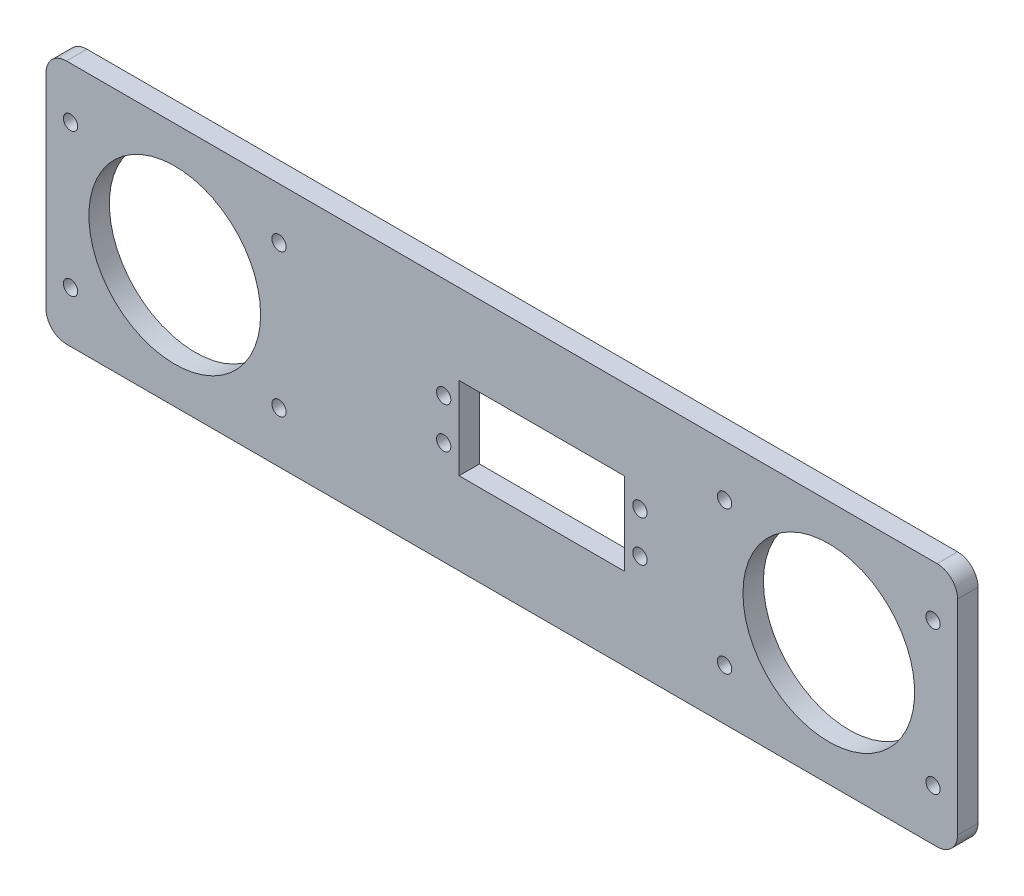
ISO-10303-21;
HEADER;
FILE_DESCRIPTION(('STEP AP214'),'2;1');
FILE_NAME('part.step','',(''),(''),'','','');
FILE_SCHEMA(('AUTOMOTIVE_DESIGN { 1 0 10303 214 1 1 1 1 }'));
ENDSEC;
DATA;
#1=APPLICATION_CONTEXT('core data for automotive mechanical design processes');
#2=APPLICATION_PROTOCOL_DEFINITION('international standard','automotive_design',2000,#1);
#3=PRODUCT_CONTEXT('',#1,'mechanical');
#4=PRODUCT('Part','Part','',(#3));
#5=PRODUCT_RELATED_PRODUCT_CATEGORY('part','',(#4));
#6=PRODUCT_DEFINITION_FORMATION('','',#4);
#7=PRODUCT_DEFINITION_CONTEXT('part definition',#1,'design');
#8=PRODUCT_DEFINITION('design','',#6,#7);
#9=PRODUCT_DEFINITION_SHAPE('','',#8);
#10=(LENGTH_UNIT() NAMED_UNIT(*) SI_UNIT(.MILLI.,.METRE.));
#11=(NAMED_UNIT(*) PLANE_ANGLE_UNIT() SI_UNIT($,.RADIAN.));
#12=(NAMED_UNIT(*) SI_UNIT($,.STERADIAN.) SOLID_ANGLE_UNIT());
#13=UNCERTAINTY_MEASURE_WITH_UNIT(LENGTH_MEASURE(1.E-05),#10,'distance_accuracy_value','');
#14=(GEOMETRIC_REPRESENTATION_CONTEXT(3) GLOBAL_UNCERTAINTY_ASSIGNED_CONTEXT((#13)) GLOBAL_UNIT_ASSIGNED_CONTEXT((#10,
#11,#12)) REPRESENTATION_CONTEXT('',''));
#15=CARTESIAN_POINT('',(0.,0.,0.));
#16=DIRECTION('',(0.,0.,1.));
#17=DIRECTION('',(1.,0.,0.));
#18=AXIS2_PLACEMENT_3D('',#15,#16,#17);
#19=CARTESIAN_POINT('',(106.5,25.,5.));
#20=DIRECTION('',(0.,0.,1.));
#21=DIRECTION('',(1.,0.,0.));
#22=AXIS2_PLACEMENT_3D('',#19,#20,#21);
#23=PLANE('',#22);
#24=CARTESIAN_POINT('',(105.500000000004,-17.5000000000001,5.));
#25=DIRECTION('',(0.,0.,1.));
#26=DIRECTION('',(-1.,0.,0.));
#27=AXIS2_PLACEMENT_3D('',#24,#25,#26);
#28=CIRCLE('',#27,1.75);
#29=CARTESIAN_POINT('',(103.750000000004,-17.5000000000001,5.));
#30=VERTEX_POINT('',#29);
#31=EDGE_CURVE('E405',#30,#30,#28,.T.);
#32=ORIENTED_EDGE('',*,*,#31,.F.);
#33=EDGE_LOOP('',(#32));
#34=FACE_BOUND('',#33,.T.);
#35=CARTESIAN_POINT('',(54.5000000000038,-17.5000000000001,5.));
#36=DIRECTION('',(0.,0.,1.));
#37=DIRECTION('',(-1.,0.,0.));
#38=AXIS2_PLACEMENT_3D('',#35,#36,#37);
#39=CIRCLE('',#38,1.75);
#40=CARTESIAN_POINT('',(52.7500000000038,-17.5000000000001,5.));
#41=VERTEX_POINT('',#40);
#42=EDGE_CURVE('E417',#41,#41,#39,.T.);
#43=ORIENTED_EDGE('',*,*,#42,.F.);
#44=EDGE_LOOP('',(#43));
#45=FACE_BOUND('',#44,.T.);
#46=CARTESIAN_POINT('',(-105.500000000004,17.4999999999999,5.));
#47=DIRECTION('',(0.,0.,1.));
#48=DIRECTION('',(1.,0.,0.));
#49=AXIS2_PLACEMENT_3D('',#46,#47,#48);
#50=CIRCLE('',#49,1.75);
#51=CARTESIAN_POINT('',(-103.750000000004,17.4999999999999,5.));
#52=VERTEX_POINT('',#51);
#53=EDGE_CURVE('E429',#52,#52,#50,.T.);
#54=ORIENTED_EDGE('',*,*,#53,.F.);
#55=EDGE_LOOP('',(#54));
#56=FACE_BOUND('',#55,.T.);
#57=CARTESIAN_POINT('',(-54.5000000000038,-17.5000000000001,5.));
#58=DIRECTION('',(0.,0.,1.));
#59=DIRECTION('',(1.,0.,0.));
#60=AXIS2_PLACEMENT_3D('',#57,#58,#59);
#61=CIRCLE('',#60,1.75);
#62=CARTESIAN_POINT('',(-52.7500000000038,-17.5000000000001,5.));
#63=VERTEX_POINT('',#62);
#64=EDGE_CURVE('E153',#63,#63,#61,.T.);
#65=ORIENTED_EDGE('',*,*,#64,.F.);
#66=EDGE_LOOP('',(#65));
#67=FACE_BOUND('',#66,.T.);
#68=CARTESIAN_POINT('',(-14.2111390943348,-4.76231465688467,5.));
#69=DIRECTION('',(0.,0.,1.));
#70=DIRECTION('',(1.,0.,0.));
#71=AXIS2_PLACEMENT_3D('',#68,#69,#70);
#72=CIRCLE('',#71,1.75);
#73=CARTESIAN_POINT('',(-12.4611390943348,-4.76231465688467,5.));
#74=VERTEX_POINT('',#73);
#75=EDGE_CURVE('E169',#74,#74,#72,.T.);
#76=ORIENTED_EDGE('',*,*,#75,.F.);
#77=EDGE_LOOP('',(#76));
#78=FACE_BOUND('',#77,.T.);
#79=CARTESIAN_POINT('',(33.7888609056652,-4.76231465688467,5.));
#80=DIRECTION('',(0.,0.,1.));
#81=DIRECTION('',(1.,0.,0.));
#82=AXIS2_PLACEMENT_3D('',#79,#80,#81);
#83=CIRCLE('',#82,1.75);
#84=CARTESIAN_POINT('',(35.5388609056652,-4.76231465688467,5.));
#85=VERTEX_POINT('',#84);
#86=EDGE_CURVE('E181',#85,#85,#83,.T.);
#87=ORIENTED_EDGE('',*,*,#86,.F.);
#88=EDGE_LOOP('',(#87));
#89=FACE_BOUND('',#88,.T.);
#90=CARTESIAN_POINT('',(-80.,0.,5.));
#91=DIRECTION('',(0.,0.,1.));
#92=DIRECTION('',(1.,0.,0.));
#93=AXIS2_PLACEMENT_3D('',#90,#91,#92);
#94=CIRCLE('',#93,21.);
#95=CARTESIAN_POINT('',(-59.,0.,5.));
#96=VERTEX_POINT('',#95);
#97=EDGE_CURVE('E193',#96,#96,#94,.T.);
#98=ORIENTED_EDGE('',*,*,#97,.F.);
#99=EDGE_LOOP('',(#98));
#100=FACE_BOUND('',#99,.T.);
#101=CARTESIAN_POINT('',(106.5,25.,5.));
#102=DIRECTION('',(0.,0.,1.));
#103=DIRECTION('',(1.,0.,0.));
#104=AXIS2_PLACEMENT_3D('',#101,#102,#103);
#105=CIRCLE('',#104,5.);
#106=CARTESIAN_POINT('',(111.5,25.,5.));
#107=VERTEX_POINT('',#106);
#108=CARTESIAN_POINT('',(106.5,30.,5.));
#109=VERTEX_POINT('',#108);
#110=EDGE_CURVE('E199',#107,#109,#105,.T.);
#111=ORIENTED_EDGE('',*,*,#110,.T.);
#112=DIRECTION('',(-1.,0.,0.));
#113=VECTOR('',#112,1.);
#114=CARTESIAN_POINT('',(106.5,30.,5.));
#115=LINE('',#114,#113);
#116=CARTESIAN_POINT('',(-106.5,30.,5.));
#117=VERTEX_POINT('',#116);
#118=EDGE_CURVE('E202',#109,#117,#115,.T.);
#119=ORIENTED_EDGE('',*,*,#118,.T.);
#120=CARTESIAN_POINT('',(-106.5,25.,5.));
#121=DIRECTION('',(0.,0.,1.));
#122=DIRECTION('',(1.,0.,0.));
#123=AXIS2_PLACEMENT_3D('',#120,#121,#122);
#124=CIRCLE('',#123,5.);
#125=CARTESIAN_POINT('',(-111.5,25.,5.));
#126=VERTEX_POINT('',#125);
#127=EDGE_CURVE('E205',#117,#126,#124,.T.);
#128=ORIENTED_EDGE('',*,*,#127,.T.);
#129=DIRECTION('',(0.,-1.,0.));
#130=VECTOR('',#129,1.);
#131=CARTESIAN_POINT('',(-111.5,-25.,5.));
#132=LINE('',#131,#130);
#133=CARTESIAN_POINT('',(-111.5,-25.,5.));
#134=VERTEX_POINT('',#133);
#135=EDGE_CURVE('E207',#126,#134,#132,.T.);
#136=ORIENTED_EDGE('',*,*,#135,.T.);
#137=CARTESIAN_POINT('',(-106.5,-25.,5.));
#138=DIRECTION('',(0.,0.,1.));
#139=DIRECTION('',(-1.,0.,0.));
#140=AXIS2_PLACEMENT_3D('',#137,#138,#139);
#141=CIRCLE('',#140,5.);
#142=CARTESIAN_POINT('',(-106.5,-30.,5.));
#143=VERTEX_POINT('',#142);
#144=EDGE_CURVE('E209',#134,#143,#141,.T.);
#145=ORIENTED_EDGE('',*,*,#144,.T.);
#146=DIRECTION('',(1.,0.,0.));
#147=VECTOR('',#146,1.);
#148=CARTESIAN_POINT('',(106.5,-30.,5.));
#149=LINE('',#148,#147);
#150=CARTESIAN_POINT('',(106.5,-30.,5.));
#151=VERTEX_POINT('',#150);
#152=EDGE_CURVE('E211',#143,#151,#149,.T.);
#153=ORIENTED_EDGE('',*,*,#152,.T.);
#154=CARTESIAN_POINT('',(106.5,-25.,5.));
#155=DIRECTION('',(0.,0.,1.));
#156=DIRECTION('',(1.,0.,0.));
#157=AXIS2_PLACEMENT_3D('',#154,#155,#156);
#158=CIRCLE('',#157,5.);
#159=CARTESIAN_POINT('',(111.5,-25.,5.));
#160=VERTEX_POINT('',#159);
#161=EDGE_CURVE('E213',#151,#160,#158,.T.);
#162=ORIENTED_EDGE('',*,*,#161,.T.);
#163=DIRECTION('',(0.,1.,0.));
#164=VECTOR('',#163,1.);
#165=CARTESIAN_POINT('',(111.5,-25.,5.));
#166=LINE('',#165,#164);
#167=EDGE_CURVE('E215',#160,#107,#166,.T.);
#168=ORIENTED_EDGE('',*,*,#167,.T.);
#169=EDGE_LOOP('',(#111,#119,#128,#136,#145,#153,#162,#168));
#170=FACE_BOUND('',#169,.T.);
#171=CARTESIAN_POINT('',(80.,0.,5.));
#172=DIRECTION('',(0.,0.,1.));
#173=DIRECTION('',(-1.,0.,0.));
#174=AXIS2_PLACEMENT_3D('',#171,#172,#173);
#175=CIRCLE('',#174,21.);
#176=CARTESIAN_POINT('',(59.,0.,5.));
#177=VERTEX_POINT('',#176);
#178=EDGE_CURVE('E187',#177,#177,#175,.T.);
#179=ORIENTED_EDGE('',*,*,#178,.F.);
#180=EDGE_LOOP('',(#179));
#181=FACE_BOUND('',#180,.T.);
#182=CARTESIAN_POINT('',(33.7888609056652,5.23768534311533,5.));
#183=DIRECTION('',(0.,0.,1.));
#184=DIRECTION('',(1.,0.,0.));
#185=AXIS2_PLACEMENT_3D('',#182,#183,#184);
#186=CIRCLE('',#185,1.75);
#187=CARTESIAN_POINT('',(35.5388609056652,5.23768534311533,5.));
#188=VERTEX_POINT('',#187);
#189=EDGE_CURVE('E175',#188,#188,#186,.T.);
#190=ORIENTED_EDGE('',*,*,#189,.F.);
#191=EDGE_LOOP('',(#190));
#192=FACE_BOUND('',#191,.T.);
#193=CARTESIAN_POINT('',(-14.2111390943348,5.23768534311533,5.));
#194=DIRECTION('',(0.,0.,1.));
#195=DIRECTION('',(1.,0.,0.));
#196=AXIS2_PLACEMENT_3D('',#193,#194,#195);
#197=CIRCLE('',#196,1.75);
#198=CARTESIAN_POINT('',(-12.4611390943348,5.23768534311533,5.));
#199=VERTEX_POINT('',#198);
#200=EDGE_CURVE('E163',#199,#199,#197,.T.);
#201=ORIENTED_EDGE('',*,*,#200,.F.);
#202=EDGE_LOOP('',(#201));
#203=FACE_BOUND('',#202,.T.);
#204=DIRECTION('',(0.,1.,0.));
#205=VECTOR('',#204,1.);
#206=CARTESIAN_POINT('',(30.0388609056652,-9.86231465688467,5.));
#207=LINE('',#206,#205);
#208=CARTESIAN_POINT('',(30.0388609056652,-9.86231465688467,5.));
#209=VERTEX_POINT('',#208);
#210=CARTESIAN_POINT('',(30.0388609056652,10.3376853431153,5.));
#211=VERTEX_POINT('',#210);
#212=EDGE_CURVE('E132',#209,#211,#207,.T.);
#213=ORIENTED_EDGE('',*,*,#212,.F.);
#214=DIRECTION('',(1.,0.,0.));
#215=VECTOR('',#214,1.);
#216=CARTESIAN_POINT('',(-10.4611390943348,-9.86231465688467,5.));
#217=LINE('',#216,#215);
#218=CARTESIAN_POINT('',(-10.4611390943348,-9.86231465688467,5.));
#219=VERTEX_POINT('',#218);
#220=EDGE_CURVE('E124',#219,#209,#217,.T.);
#221=ORIENTED_EDGE('',*,*,#220,.F.);
#222=DIRECTION('',(0.,-1.,0.));
#223=VECTOR('',#222,1.);
#224=CARTESIAN_POINT('',(-10.4611390943348,10.3376853431153,5.));
#225=LINE('',#224,#223);
#226=CARTESIAN_POINT('',(-10.4611390943348,10.3376853431153,5.));
#227=VERTEX_POINT('',#226);
#228=EDGE_CURVE('E147',#227,#219,#225,.T.);
#229=ORIENTED_EDGE('',*,*,#228,.F.);
#230=DIRECTION('',(-1.,0.,0.));
#231=VECTOR('',#230,1.);
#232=CARTESIAN_POINT('',(30.0388609056652,10.3376853431153,5.));
#233=LINE('',#232,#231);
#234=EDGE_CURVE('E145',#211,#227,#233,.T.);
#235=ORIENTED_EDGE('',*,*,#234,.F.);
#236=EDGE_LOOP('',(#213,#221,#229,#235));
#237=FACE_BOUND('',#236,.T.);
#238=CARTESIAN_POINT('',(-105.500000000004,-17.5000000000001,5.));
#239=DIRECTION('',(0.,0.,1.));
#240=DIRECTION('',(1.,0.,0.));
#241=AXIS2_PLACEMENT_3D('',#238,#239,#240);
#242=CIRCLE('',#241,1.75);
#243=CARTESIAN_POINT('',(-103.750000000004,-17.5000000000001,5.));
#244=VERTEX_POINT('',#243);
#245=EDGE_CURVE('E435',#244,#244,#242,.T.);
#246=ORIENTED_EDGE('',*,*,#245,.F.);
#247=EDGE_LOOP('',(#246));
#248=FACE_BOUND('',#247,.T.);
#249=CARTESIAN_POINT('',(-54.5000000000045,17.5000000000001,5.));
#250=DIRECTION('',(0.,0.,1.));
#251=DIRECTION('',(1.,0.,0.));
#252=AXIS2_PLACEMENT_3D('',#249,#250,#251);
#253=CIRCLE('',#252,1.75);
#254=CARTESIAN_POINT('',(-52.7500000000045,17.5000000000001,5.));
#255=VERTEX_POINT('',#254);
#256=EDGE_CURVE('E423',#255,#255,#253,.T.);
#257=ORIENTED_EDGE('',*,*,#256,.F.);
#258=EDGE_LOOP('',(#257));
#259=FACE_BOUND('',#258,.T.);
#260=CARTESIAN_POINT('',(54.5000000000045,17.5000000000001,5.));
#261=DIRECTION('',(0.,0.,1.));
#262=DIRECTION('',(-1.,0.,0.));
#263=AXIS2_PLACEMENT_3D('',#260,#261,#262);
#264=CIRCLE('',#263,1.75);
#265=CARTESIAN_POINT('',(52.7500000000045,17.5000000000001,5.));
#266=VERTEX_POINT('',#265);
#267=EDGE_CURVE('E411',#266,#266,#264,.T.);
#268=ORIENTED_EDGE('',*,*,#267,.F.);
#269=EDGE_LOOP('',(#268));
#270=FACE_BOUND('',#269,.T.);
#271=CARTESIAN_POINT('',(105.500000000004,17.4999999999999,5.));
#272=DIRECTION('',(0.,0.,1.));
#273=DIRECTION('',(-1.,0.,0.));
#274=AXIS2_PLACEMENT_3D('',#271,#272,#273);
#275=CIRCLE('',#274,1.75);
#276=CARTESIAN_POINT('',(103.750000000004,17.4999999999999,5.));
#277=VERTEX_POINT('',#276);
#278=EDGE_CURVE('E396',#277,#277,#275,.T.);
#279=ORIENTED_EDGE('',*,*,#278,.F.);
#280=EDGE_LOOP('',(#279));
#281=FACE_BOUND('',#280,.T.);
#282=ADVANCED_FACE('F35',(#34,#45,#56,#67,#78,#89,#100,#170,#181,#192,#203,#237,#248,#259,#270,
#281),#23,.T.);
#283=CARTESIAN_POINT('',(106.5,25.,0.));
#284=DIRECTION('',(0.,0.,1.));
#285=DIRECTION('',(1.,0.,0.));
#286=AXIS2_PLACEMENT_3D('',#283,#284,#285);
#287=PLANE('',#286);
#288=CARTESIAN_POINT('',(-14.2111390943348,5.23768534311533,0.));
#289=DIRECTION('',(0.,0.,1.));
#290=DIRECTION('',(1.,0.,0.));
#291=AXIS2_PLACEMENT_3D('',#288,#289,#290);
#292=CIRCLE('',#291,1.75);
#293=CARTESIAN_POINT('',(-12.4611390943348,5.23768534311533,0.));
#294=VERTEX_POINT('',#293);
#295=EDGE_CURVE('E140',#294,#294,#292,.T.);
#296=ORIENTED_EDGE('',*,*,#295,.T.);
#297=EDGE_LOOP('',(#296));
#298=FACE_BOUND('',#297,.T.);
#299=CARTESIAN_POINT('',(-14.2111390943348,-4.76231465688467,0.));
#300=DIRECTION('',(0.,0.,1.));
#301=DIRECTION('',(1.,0.,0.));
#302=AXIS2_PLACEMENT_3D('',#299,#300,#301);
#303=CIRCLE('',#302,1.75);
#304=CARTESIAN_POINT('',(-12.4611390943348,-4.76231465688467,0.));
#305=VERTEX_POINT('',#304);
#306=EDGE_CURVE('E166',#305,#305,#303,.T.);
#307=ORIENTED_EDGE('',*,*,#306,.T.);
#308=EDGE_LOOP('',(#307));
#309=FACE_BOUND('',#308,.T.);
#310=CARTESIAN_POINT('',(33.7888609056652,5.23768534311533,0.));
#311=DIRECTION('',(0.,0.,1.));
#312=DIRECTION('',(1.,0.,0.));
#313=AXIS2_PLACEMENT_3D('',#310,#311,#312);
#314=CIRCLE('',#313,1.75);
#315=CARTESIAN_POINT('',(35.5388609056652,5.23768534311533,0.));
#316=VERTEX_POINT('',#315);
#317=EDGE_CURVE('E172',#316,#316,#314,.T.);
#318=ORIENTED_EDGE('',*,*,#317,.T.);
#319=EDGE_LOOP('',(#318));
#320=FACE_BOUND('',#319,.T.);
#321=CARTESIAN_POINT('',(33.7888609056652,-4.76231465688467,0.));
#322=DIRECTION('',(0.,0.,1.));
#323=DIRECTION('',(1.,0.,0.));
#324=AXIS2_PLACEMENT_3D('',#321,#322,#323);
#325=CIRCLE('',#324,1.75);
#326=CARTESIAN_POINT('',(35.5388609056652,-4.76231465688467,0.));
#327=VERTEX_POINT('',#326);
#328=EDGE_CURVE('E178',#327,#327,#325,.T.);
#329=ORIENTED_EDGE('',*,*,#328,.T.);
#330=EDGE_LOOP('',(#329));
#331=FACE_BOUND('',#330,.T.);
#332=CARTESIAN_POINT('',(80.,0.,0.));
#333=DIRECTION('',(0.,0.,1.));
#334=DIRECTION('',(-1.,0.,0.));
#335=AXIS2_PLACEMENT_3D('',#332,#333,#334);
#336=CIRCLE('',#335,21.);
#337=CARTESIAN_POINT('',(59.,0.,0.));
#338=VERTEX_POINT('',#337);
#339=EDGE_CURVE('E184',#338,#338,#336,.T.);
#340=ORIENTED_EDGE('',*,*,#339,.T.);
#341=EDGE_LOOP('',(#340));
#342=FACE_BOUND('',#341,.T.);
#343=CARTESIAN_POINT('',(-80.,0.,0.));
#344=DIRECTION('',(0.,0.,1.));
#345=DIRECTION('',(1.,0.,0.));
#346=AXIS2_PLACEMENT_3D('',#343,#344,#345);
#347=CIRCLE('',#346,21.);
#348=CARTESIAN_POINT('',(-59.,0.,0.));
#349=VERTEX_POINT('',#348);
#350=EDGE_CURVE('E190',#349,#349,#347,.T.);
#351=ORIENTED_EDGE('',*,*,#350,.T.);
#352=EDGE_LOOP('',(#351));
#353=FACE_BOUND('',#352,.T.);
#354=CARTESIAN_POINT('',(106.5,25.,0.));
#355=DIRECTION('',(0.,0.,1.));
#356=DIRECTION('',(1.,0.,0.));
#357=AXIS2_PLACEMENT_3D('',#354,#355,#356);
#358=CIRCLE('',#357,5.);
#359=CARTESIAN_POINT('',(111.5,25.,0.));
#360=VERTEX_POINT('',#359);
#361=CARTESIAN_POINT('',(106.5,30.,0.));
#362=VERTEX_POINT('',#361);
#363=EDGE_CURVE('E196',#360,#362,#358,.T.);
#364=ORIENTED_EDGE('',*,*,#363,.F.);
#365=DIRECTION('',(0.,1.,0.));
#366=VECTOR('',#365,1.);
#367=CARTESIAN_POINT('',(111.5,-25.,0.));
#368=LINE('',#367,#366);
#369=CARTESIAN_POINT('',(111.5,-25.,0.));
#370=VERTEX_POINT('',#369);
#371=EDGE_CURVE('E203',#370,#360,#368,.T.);
#372=ORIENTED_EDGE('',*,*,#371,.F.);
#373=CARTESIAN_POINT('',(106.5,-25.,0.));
#374=DIRECTION('',(0.,0.,1.));
#375=DIRECTION('',(1.,0.,0.));
#376=AXIS2_PLACEMENT_3D('',#373,#374,#375);
#377=CIRCLE('',#376,5.);
#378=CARTESIAN_POINT('',(106.5,-30.,0.));
#379=VERTEX_POINT('',#378);
#380=EDGE_CURVE('E230',#379,#370,#377,.T.);
#381=ORIENTED_EDGE('',*,*,#380,.F.);
#382=DIRECTION('',(1.,0.,0.));
#383=VECTOR('',#382,1.);
#384=CARTESIAN_POINT('',(106.5,-30.,0.));
#385=LINE('',#384,#383);
#386=CARTESIAN_POINT('',(-106.5,-30.,0.));
#387=VERTEX_POINT('',#386);
#388=EDGE_CURVE('E228',#387,#379,#385,.T.);
#389=ORIENTED_EDGE('',*,*,#388,.F.);
#390=CARTESIAN_POINT('',(-106.5,-25.,0.));
#391=DIRECTION('',(0.,0.,1.));
#392=DIRECTION('',(-1.,0.,0.));
#393=AXIS2_PLACEMENT_3D('',#390,#391,#392);
#394=CIRCLE('',#393,5.);
#395=CARTESIAN_POINT('',(-111.5,-25.,0.));
#396=VERTEX_POINT('',#395);
#397=EDGE_CURVE('E226',#396,#387,#394,.T.);
#398=ORIENTED_EDGE('',*,*,#397,.F.);
#399=DIRECTION('',(0.,-1.,0.));
#400=VECTOR('',#399,1.);
#401=CARTESIAN_POINT('',(-111.5,-25.,0.));
#402=LINE('',#401,#400);
#403=CARTESIAN_POINT('',(-111.5,25.,0.));
#404=VERTEX_POINT('',#403);
#405=EDGE_CURVE('E224',#404,#396,#402,.T.);
#406=ORIENTED_EDGE('',*,*,#405,.F.);
#407=CARTESIAN_POINT('',(-106.5,25.,0.));
#408=DIRECTION('',(0.,0.,1.));
#409=DIRECTION('',(1.,0.,0.));
#410=AXIS2_PLACEMENT_3D('',#407,#408,#409);
#411=CIRCLE('',#410,5.);
#412=CARTESIAN_POINT('',(-106.5,30.,0.));
#413=VERTEX_POINT('',#412);
#414=EDGE_CURVE('E222',#413,#404,#411,.T.);
#415=ORIENTED_EDGE('',*,*,#414,.F.);
#416=DIRECTION('',(-1.,0.,0.));
#417=VECTOR('',#416,1.);
#418=CARTESIAN_POINT('',(106.5,30.,0.));
#419=LINE('',#418,#417);
#420=EDGE_CURVE('E220',#362,#413,#419,.T.);
#421=ORIENTED_EDGE('',*,*,#420,.F.);
#422=EDGE_LOOP('',(#364,#372,#381,#389,#398,#406,#415,#421));
#423=FACE_BOUND('',#422,.T.);
#424=DIRECTION('',(1.,0.,0.));
#425=VECTOR('',#424,1.);
#426=CARTESIAN_POINT('',(-10.4611390943348,-9.86231465688467,0.));
#427=LINE('',#426,#425);
#428=CARTESIAN_POINT('',(-10.4611390943348,-9.86231465688467,0.));
#429=VERTEX_POINT('',#428);
#430=CARTESIAN_POINT('',(30.0388609056652,-9.86231465688467,0.));
#431=VERTEX_POINT('',#430);
#432=EDGE_CURVE('E58',#429,#431,#427,.T.);
#433=ORIENTED_EDGE('',*,*,#432,.T.);
#434=DIRECTION('',(0.,1.,0.));
#435=VECTOR('',#434,1.);
#436=CARTESIAN_POINT('',(30.0388609056652,-9.86231465688467,0.));
#437=LINE('',#436,#435);
#438=CARTESIAN_POINT('',(30.0388609056652,10.3376853431153,0.));
#439=VERTEX_POINT('',#438);
#440=EDGE_CURVE('E139',#431,#439,#437,.T.);
#441=ORIENTED_EDGE('',*,*,#440,.T.);
#442=DIRECTION('',(-1.,0.,0.));
#443=VECTOR('',#442,1.);
#444=CARTESIAN_POINT('',(30.0388609056652,10.3376853431153,0.));
#445=LINE('',#444,#443);
#446=CARTESIAN_POINT('',(-10.4611390943348,10.3376853431153,0.));
#447=VERTEX_POINT('',#446);
#448=EDGE_CURVE('E155',#439,#447,#445,.T.);
#449=ORIENTED_EDGE('',*,*,#448,.T.);
#450=DIRECTION('',(0.,-1.,0.));
#451=VECTOR('',#450,1.);
#452=CARTESIAN_POINT('',(-10.4611390943348,10.3376853431153,0.));
#453=LINE('',#452,#451);
#454=EDGE_CURVE('E133',#447,#429,#453,.T.);
#455=ORIENTED_EDGE('',*,*,#454,.T.);
#456=EDGE_LOOP('',(#433,#441,#449,#455));
#457=FACE_BOUND('',#456,.T.);
#458=CARTESIAN_POINT('',(-54.5000000000038,-17.5000000000001,0.));
#459=DIRECTION('',(0.,0.,1.));
#460=DIRECTION('',(1.,0.,0.));
#461=AXIS2_PLACEMENT_3D('',#458,#459,#460);
#462=CIRCLE('',#461,1.75);
#463=CARTESIAN_POINT('',(-52.7500000000038,-17.5000000000001,0.));
#464=VERTEX_POINT('',#463);
#465=EDGE_CURVE('E438',#464,#464,#462,.T.);
#466=ORIENTED_EDGE('',*,*,#465,.T.);
#467=EDGE_LOOP('',(#466));
#468=FACE_BOUND('',#467,.T.);
#469=CARTESIAN_POINT('',(-105.500000000004,-17.5000000000001,0.));
#470=DIRECTION('',(0.,0.,1.));
#471=DIRECTION('',(1.,0.,0.));
#472=AXIS2_PLACEMENT_3D('',#469,#470,#471);
#473=CIRCLE('',#472,1.75);
#474=CARTESIAN_POINT('',(-103.750000000004,-17.5000000000001,0.));
#475=VERTEX_POINT('',#474);
#476=EDGE_CURVE('E432',#475,#475,#473,.T.);
#477=ORIENTED_EDGE('',*,*,#476,.T.);
#478=EDGE_LOOP('',(#477));
#479=FACE_BOUND('',#478,.T.);
#480=CARTESIAN_POINT('',(-105.500000000004,17.4999999999999,0.));
#481=DIRECTION('',(0.,0.,1.));
#482=DIRECTION('',(1.,0.,0.));
#483=AXIS2_PLACEMENT_3D('',#480,#481,#482);
#484=CIRCLE('',#483,1.75);
#485=CARTESIAN_POINT('',(-103.750000000004,17.4999999999999,0.));
#486=VERTEX_POINT('',#485);
#487=EDGE_CURVE('E426',#486,#486,#484,.T.);
#488=ORIENTED_EDGE('',*,*,#487,.T.);
#489=EDGE_LOOP('',(#488));
#490=FACE_BOUND('',#489,.T.);
#491=CARTESIAN_POINT('',(-54.5000000000045,17.5000000000001,0.));
#492=DIRECTION('',(0.,0.,1.));
#493=DIRECTION('',(1.,0.,0.));
#494=AXIS2_PLACEMENT_3D('',#491,#492,#493);
#495=CIRCLE('',#494,1.75);
#496=CARTESIAN_POINT('',(-52.7500000000045,17.5000000000001,0.));
#497=VERTEX_POINT('',#496);
#498=EDGE_CURVE('E420',#497,#497,#495,.T.);
#499=ORIENTED_EDGE('',*,*,#498,.T.);
#500=EDGE_LOOP('',(#499));
#501=FACE_BOUND('',#500,.T.);
#502=CARTESIAN_POINT('',(54.5000000000038,-17.5000000000001,0.));
#503=DIRECTION('',(0.,0.,1.));
#504=DIRECTION('',(-1.,0.,0.));
#505=AXIS2_PLACEMENT_3D('',#502,#503,#504);
#506=CIRCLE('',#505,1.75);
#507=CARTESIAN_POINT('',(52.7500000000038,-17.5000000000001,0.));
#508=VERTEX_POINT('',#507);
#509=EDGE_CURVE('E414',#508,#508,#506,.T.);
#510=ORIENTED_EDGE('',*,*,#509,.T.);
#511=EDGE_LOOP('',(#510));
#512=FACE_BOUND('',#511,.T.);
#513=CARTESIAN_POINT('',(54.5000000000045,17.5000000000001,0.));
#514=DIRECTION('',(0.,0.,1.));
#515=DIRECTION('',(-1.,0.,0.));
#516=AXIS2_PLACEMENT_3D('',#513,#514,#515);
#517=CIRCLE('',#516,1.75);
#518=CARTESIAN_POINT('',(52.7500000000045,17.5000000000001,0.));
#519=VERTEX_POINT('',#518);
#520=EDGE_CURVE('E408',#519,#519,#517,.T.);
#521=ORIENTED_EDGE('',*,*,#520,.T.);
#522=EDGE_LOOP('',(#521));
#523=FACE_BOUND('',#522,.T.);
#524=CARTESIAN_POINT('',(105.500000000004,-17.5000000000001,0.));
#525=DIRECTION('',(0.,0.,1.));
#526=DIRECTION('',(-1.,0.,0.));
#527=AXIS2_PLACEMENT_3D('',#524,#525,#526);
#528=CIRCLE('',#527,1.75);
#529=CARTESIAN_POINT('',(103.750000000004,-17.5000000000001,0.));
#530=VERTEX_POINT('',#529);
#531=EDGE_CURVE('E402',#530,#530,#528,.T.);
#532=ORIENTED_EDGE('',*,*,#531,.T.);
#533=EDGE_LOOP('',(#532));
#534=FACE_BOUND('',#533,.T.);
#535=CARTESIAN_POINT('',(105.500000000004,17.4999999999999,0.));
#536=DIRECTION('',(0.,0.,1.));
#537=DIRECTION('',(-1.,0.,0.));
#538=AXIS2_PLACEMENT_3D('',#535,#536,#537);
#539=CIRCLE('',#538,1.75);
#540=CARTESIAN_POINT('',(103.750000000004,17.4999999999999,0.));
#541=VERTEX_POINT('',#540);
#542=EDGE_CURVE('E399',#541,#541,#539,.T.);
#543=ORIENTED_EDGE('',*,*,#542,.T.);
#544=EDGE_LOOP('',(#543));
#545=FACE_BOUND('',#544,.T.);
#546=ADVANCED_FACE('F260',(#298,#309,#320,#331,#342,#353,#423,#457,#468,#479,#490,#501,#512,
#523,#534,#545),#287,.F.);
#547=CARTESIAN_POINT('',(106.5,25.,5.));
#548=DIRECTION('',(0.,0.,-1.));
#549=DIRECTION('',(-1.,0.,0.));
#550=AXIS2_PLACEMENT_3D('',#547,#548,#549);
#551=CYLINDRICAL_SURFACE('',#550,5.);
#552=ORIENTED_EDGE('',*,*,#363,.T.);
#553=DIRECTION('',(0.,0.,-1.));
#554=VECTOR('',#553,1.);
#555=CARTESIAN_POINT('',(106.5,30.,5.));
#556=LINE('',#555,#554);
#557=EDGE_CURVE('E11',#109,#362,#556,.T.);
#558=ORIENTED_EDGE('',*,*,#557,.F.);
#559=ORIENTED_EDGE('',*,*,#110,.F.);
#560=DIRECTION('',(0.,0.,-1.));
#561=VECTOR('',#560,1.);
#562=CARTESIAN_POINT('',(111.5,25.,5.));
#563=LINE('',#562,#561);
#564=EDGE_CURVE('E217',#107,#360,#563,.T.);
#565=ORIENTED_EDGE('',*,*,#564,.T.);
#566=EDGE_LOOP('',(#552,#558,#559,#565));
#567=FACE_BOUND('',#566,.T.);
#568=ADVANCED_FACE('F37',(#567),#551,.T.);
#569=CARTESIAN_POINT('',(106.5,30.,5.));
#570=DIRECTION('',(0.,-1.,0.));
#571=DIRECTION('',(0.,0.,-1.));
#572=AXIS2_PLACEMENT_3D('',#569,#570,#571);
#573=PLANE('',#572);
#574=ORIENTED_EDGE('',*,*,#420,.T.);
#575=DIRECTION('',(0.,0.,-1.));
#576=VECTOR('',#575,1.);
#577=CARTESIAN_POINT('',(-106.5,30.,5.));
#578=LINE('',#577,#576);
#579=EDGE_CURVE('E43',#117,#413,#578,.T.);
#580=ORIENTED_EDGE('',*,*,#579,.F.);
#581=ORIENTED_EDGE('',*,*,#118,.F.);
#582=ORIENTED_EDGE('',*,*,#557,.T.);
#583=EDGE_LOOP('',(#574,#580,#581,#582));
#584=FACE_BOUND('',#583,.T.);
#585=ADVANCED_FACE('F278',(#584),#573,.F.);
#586=CARTESIAN_POINT('',(-106.5,25.,5.));
#587=DIRECTION('',(0.,0.,-1.));
#588=DIRECTION('',(-1.,0.,0.));
#589=AXIS2_PLACEMENT_3D('',#586,#587,#588);
#590=CYLINDRICAL_SURFACE('',#589,5.);
#591=ORIENTED_EDGE('',*,*,#414,.T.);
#592=DIRECTION('',(0.,0.,-1.));
#593=VECTOR('',#592,1.);
#594=CARTESIAN_POINT('',(-111.5,25.,5.));
#595=LINE('',#594,#593);
#596=EDGE_CURVE('E247',#126,#404,#595,.T.);
#597=ORIENTED_EDGE('',*,*,#596,.F.);
#598=ORIENTED_EDGE('',*,*,#127,.F.);
#599=ORIENTED_EDGE('',*,*,#579,.T.);
#600=EDGE_LOOP('',(#591,#597,#598,#599));
#601=FACE_BOUND('',#600,.T.);
#602=ADVANCED_FACE('F254',(#601),#590,.T.);
#603=CARTESIAN_POINT('',(-111.5,-25.,5.));
#604=DIRECTION('',(1.,0.,0.));
#605=DIRECTION('',(0.,0.,-1.));
#606=AXIS2_PLACEMENT_3D('',#603,#604,#605);
#607=PLANE('',#606);
#608=ORIENTED_EDGE('',*,*,#405,.T.);
#609=DIRECTION('',(0.,0.,-1.));
#610=VECTOR('',#609,1.);
#611=CARTESIAN_POINT('',(-111.5,-25.,5.));
#612=LINE('',#611,#610);
#613=EDGE_CURVE('E244',#134,#396,#612,.T.);
#614=ORIENTED_EDGE('',*,*,#613,.F.);
#615=ORIENTED_EDGE('',*,*,#135,.F.);
#616=ORIENTED_EDGE('',*,*,#596,.T.);
#617=EDGE_LOOP('',(#608,#614,#615,#616));
#618=FACE_BOUND('',#617,.T.);
#619=ADVANCED_FACE('F266',(#618),#607,.F.);
#620=CARTESIAN_POINT('',(-106.5,-25.,5.));
#621=DIRECTION('',(0.,0.,-1.));
#622=DIRECTION('',(-1.,0.,0.));
#623=AXIS2_PLACEMENT_3D('',#620,#621,#622);
#624=CYLINDRICAL_SURFACE('',#623,5.);
#625=ORIENTED_EDGE('',*,*,#397,.T.);
#626=DIRECTION('',(0.,0.,-1.));
#627=VECTOR('',#626,1.);
#628=CARTESIAN_POINT('',(-106.5,-30.,5.));
#629=LINE('',#628,#627);
#630=EDGE_CURVE('E241',#143,#387,#629,.T.);
#631=ORIENTED_EDGE('',*,*,#630,.F.);
#632=ORIENTED_EDGE('',*,*,#144,.F.);
#633=ORIENTED_EDGE('',*,*,#613,.T.);
#634=EDGE_LOOP('',(#625,#631,#632,#633));
#635=FACE_BOUND('',#634,.T.);
#636=ADVANCED_FACE('F270',(#635),#624,.T.);
#637=CARTESIAN_POINT('',(106.5,-30.,5.));
#638=DIRECTION('',(0.,1.,0.));
#639=DIRECTION('',(0.,0.,1.));
#640=AXIS2_PLACEMENT_3D('',#637,#638,#639);
#641=PLANE('',#640);
#642=ORIENTED_EDGE('',*,*,#388,.T.);
#643=DIRECTION('',(0.,0.,-1.));
#644=VECTOR('',#643,1.);
#645=CARTESIAN_POINT('',(106.5,-30.,5.));
#646=LINE('',#645,#644);
#647=EDGE_CURVE('E238',#151,#379,#646,.T.);
#648=ORIENTED_EDGE('',*,*,#647,.F.);
#649=ORIENTED_EDGE('',*,*,#152,.F.);
#650=ORIENTED_EDGE('',*,*,#630,.T.);
#651=EDGE_LOOP('',(#642,#648,#649,#650));
#652=FACE_BOUND('',#651,.T.);
#653=ADVANCED_FACE('F291',(#652),#641,.F.);
#654=CARTESIAN_POINT('',(106.5,-25.,5.));
#655=DIRECTION('',(0.,0.,-1.));
#656=DIRECTION('',(-1.,0.,0.));
#657=AXIS2_PLACEMENT_3D('',#654,#655,#656);
#658=CYLINDRICAL_SURFACE('',#657,5.);
#659=ORIENTED_EDGE('',*,*,#380,.T.);
#660=DIRECTION('',(0.,0.,-1.));
#661=VECTOR('',#660,1.);
#662=CARTESIAN_POINT('',(111.5,-25.,5.));
#663=LINE('',#662,#661);
#664=EDGE_CURVE('E235',#160,#370,#663,.T.);
#665=ORIENTED_EDGE('',*,*,#664,.F.);
#666=ORIENTED_EDGE('',*,*,#161,.F.);
#667=ORIENTED_EDGE('',*,*,#647,.T.);
#668=EDGE_LOOP('',(#659,#665,#666,#667));
#669=FACE_BOUND('',#668,.T.);
#670=ADVANCED_FACE('F289',(#669),#658,.T.);
#671=CARTESIAN_POINT('',(111.5,-25.,5.));
#672=DIRECTION('',(-1.,0.,0.));
#673=DIRECTION('',(0.,0.,1.));
#674=AXIS2_PLACEMENT_3D('',#671,#672,#673);
#675=PLANE('',#674);
#676=ORIENTED_EDGE('',*,*,#371,.T.);
#677=ORIENTED_EDGE('',*,*,#564,.F.);
#678=ORIENTED_EDGE('',*,*,#167,.F.);
#679=ORIENTED_EDGE('',*,*,#664,.T.);
#680=EDGE_LOOP('',(#676,#677,#678,#679));
#681=FACE_BOUND('',#680,.T.);
#682=ADVANCED_FACE('F284',(#681),#675,.F.);
#683=CARTESIAN_POINT('',(-80.,0.,5.));
#684=DIRECTION('',(0.,0.,-1.));
#685=DIRECTION('',(-1.,0.,0.));
#686=AXIS2_PLACEMENT_3D('',#683,#684,#685);
#687=CYLINDRICAL_SURFACE('',#686,21.);
#688=ORIENTED_EDGE('',*,*,#97,.T.);
#689=EDGE_LOOP('',(#688));
#690=FACE_BOUND('',#689,.T.);
#691=ORIENTED_EDGE('',*,*,#350,.F.);
#692=EDGE_LOOP('',(#691));
#693=FACE_BOUND('',#692,.T.);
#694=ADVANCED_FACE('F311',(#690,#693),#687,.F.);
#695=CARTESIAN_POINT('',(80.,0.,5.));
#696=DIRECTION('',(0.,0.,-1.));
#697=DIRECTION('',(-1.,0.,0.));
#698=AXIS2_PLACEMENT_3D('',#695,#696,#697);
#699=CYLINDRICAL_SURFACE('',#698,21.);
#700=ORIENTED_EDGE('',*,*,#178,.T.);
#701=EDGE_LOOP('',(#700));
#702=FACE_BOUND('',#701,.T.);
#703=ORIENTED_EDGE('',*,*,#339,.F.);
#704=EDGE_LOOP('',(#703));
#705=FACE_BOUND('',#704,.T.);
#706=ADVANCED_FACE('F318',(#702,#705),#699,.F.);
#707=CARTESIAN_POINT('',(33.7888609056652,-4.76231465688467,5.));
#708=DIRECTION('',(0.,0.,-1.));
#709=DIRECTION('',(-1.,0.,0.));
#710=AXIS2_PLACEMENT_3D('',#707,#708,#709);
#711=CYLINDRICAL_SURFACE('',#710,1.75);
#712=ORIENTED_EDGE('',*,*,#86,.T.);
#713=EDGE_LOOP('',(#712));
#714=FACE_BOUND('',#713,.T.);
#715=ORIENTED_EDGE('',*,*,#328,.F.);
#716=EDGE_LOOP('',(#715));
#717=FACE_BOUND('',#716,.T.);
#718=ADVANCED_FACE('F323',(#714,#717),#711,.F.);
#719=CARTESIAN_POINT('',(33.7888609056652,5.23768534311533,5.));
#720=DIRECTION('',(0.,0.,-1.));
#721=DIRECTION('',(-1.,0.,0.));
#722=AXIS2_PLACEMENT_3D('',#719,#720,#721);
#723=CYLINDRICAL_SURFACE('',#722,1.75);
#724=ORIENTED_EDGE('',*,*,#189,.T.);
#725=EDGE_LOOP('',(#724));
#726=FACE_BOUND('',#725,.T.);
#727=ORIENTED_EDGE('',*,*,#317,.F.);
#728=EDGE_LOOP('',(#727));
#729=FACE_BOUND('',#728,.T.);
#730=ADVANCED_FACE('F333',(#726,#729),#723,.F.);
#731=CARTESIAN_POINT('',(-14.2111390943348,-4.76231465688467,5.));
#732=DIRECTION('',(0.,0.,-1.));
#733=DIRECTION('',(-1.,0.,0.));
#734=AXIS2_PLACEMENT_3D('',#731,#732,#733);
#735=CYLINDRICAL_SURFACE('',#734,1.75);
#736=ORIENTED_EDGE('',*,*,#75,.T.);
#737=EDGE_LOOP('',(#736));
#738=FACE_BOUND('',#737,.T.);
#739=ORIENTED_EDGE('',*,*,#306,.F.);
#740=EDGE_LOOP('',(#739));
#741=FACE_BOUND('',#740,.T.);
#742=ADVANCED_FACE('F340',(#738,#741),#735,.F.);
#743=CARTESIAN_POINT('',(-14.2111390943348,5.23768534311533,5.));
#744=DIRECTION('',(0.,0.,-1.));
#745=DIRECTION('',(-1.,0.,0.));
#746=AXIS2_PLACEMENT_3D('',#743,#744,#745);
#747=CYLINDRICAL_SURFACE('',#746,1.75);
#748=ORIENTED_EDGE('',*,*,#200,.T.);
#749=EDGE_LOOP('',(#748));
#750=FACE_BOUND('',#749,.T.);
#751=ORIENTED_EDGE('',*,*,#295,.F.);
#752=EDGE_LOOP('',(#751));
#753=FACE_BOUND('',#752,.T.);
#754=ADVANCED_FACE('F344',(#750,#753),#747,.F.);
#755=CARTESIAN_POINT('',(-10.4611390943348,-9.86231465688467,5.));
#756=DIRECTION('',(0.,1.,0.));
#757=DIRECTION('',(0.,0.,1.));
#758=AXIS2_PLACEMENT_3D('',#755,#756,#757);
#759=PLANE('',#758);
#760=ORIENTED_EDGE('',*,*,#432,.F.);
#761=DIRECTION('',(0.,0.,-1.));
#762=VECTOR('',#761,1.);
#763=CARTESIAN_POINT('',(-10.4611390943348,-9.86231465688467,5.));
#764=LINE('',#763,#762);
#765=EDGE_CURVE('E128',#219,#429,#764,.T.);
#766=ORIENTED_EDGE('',*,*,#765,.F.);
#767=ORIENTED_EDGE('',*,*,#220,.T.);
#768=DIRECTION('',(0.,0.,-1.));
#769=VECTOR('',#768,1.);
#770=CARTESIAN_POINT('',(30.0388609056652,-9.86231465688467,5.));
#771=LINE('',#770,#769);
#772=EDGE_CURVE('E127',#209,#431,#771,.T.);
#773=ORIENTED_EDGE('',*,*,#772,.T.);
#774=EDGE_LOOP('',(#760,#766,#767,#773));
#775=FACE_BOUND('',#774,.T.);
#776=ADVANCED_FACE('F126',(#775),#759,.T.);
#777=CARTESIAN_POINT('',(30.0388609056652,-9.86231465688467,5.));
#778=DIRECTION('',(-1.,0.,0.));
#779=DIRECTION('',(0.,0.,1.));
#780=AXIS2_PLACEMENT_3D('',#777,#778,#779);
#781=PLANE('',#780);
#782=ORIENTED_EDGE('',*,*,#440,.F.);
#783=ORIENTED_EDGE('',*,*,#772,.F.);
#784=ORIENTED_EDGE('',*,*,#212,.T.);
#785=DIRECTION('',(0.,0.,-1.));
#786=VECTOR('',#785,1.);
#787=CARTESIAN_POINT('',(30.0388609056652,10.3376853431153,5.));
#788=LINE('',#787,#786);
#789=EDGE_CURVE('E141',#211,#439,#788,.T.);
#790=ORIENTED_EDGE('',*,*,#789,.T.);
#791=EDGE_LOOP('',(#782,#783,#784,#790));
#792=FACE_BOUND('',#791,.T.);
#793=ADVANCED_FACE('F136',(#792),#781,.T.);
#794=CARTESIAN_POINT('',(30.0388609056652,10.3376853431153,5.));
#795=DIRECTION('',(0.,-1.,0.));
#796=DIRECTION('',(0.,0.,-1.));
#797=AXIS2_PLACEMENT_3D('',#794,#795,#796);
#798=PLANE('',#797);
#799=ORIENTED_EDGE('',*,*,#448,.F.);
#800=ORIENTED_EDGE('',*,*,#789,.F.);
#801=ORIENTED_EDGE('',*,*,#234,.T.);
#802=DIRECTION('',(0.,0.,-1.));
#803=VECTOR('',#802,1.);
#804=CARTESIAN_POINT('',(-10.4611390943348,10.3376853431153,5.));
#805=LINE('',#804,#803);
#806=EDGE_CURVE('E50',#227,#447,#805,.T.);
#807=ORIENTED_EDGE('',*,*,#806,.T.);
#808=EDGE_LOOP('',(#799,#800,#801,#807));
#809=FACE_BOUND('',#808,.T.);
#810=ADVANCED_FACE('F353',(#809),#798,.T.);
#811=CARTESIAN_POINT('',(-10.4611390943348,10.3376853431153,5.));
#812=DIRECTION('',(1.,0.,0.));
#813=DIRECTION('',(0.,0.,-1.));
#814=AXIS2_PLACEMENT_3D('',#811,#812,#813);
#815=PLANE('',#814);
#816=ORIENTED_EDGE('',*,*,#454,.F.);
#817=ORIENTED_EDGE('',*,*,#806,.F.);
#818=ORIENTED_EDGE('',*,*,#228,.T.);
#819=ORIENTED_EDGE('',*,*,#765,.T.);
#820=EDGE_LOOP('',(#816,#817,#818,#819));
#821=FACE_BOUND('',#820,.T.);
#822=ADVANCED_FACE('F356',(#821),#815,.T.);
#823=CARTESIAN_POINT('',(-54.5000000000038,-17.5000000000001,5.));
#824=DIRECTION('',(0.,0.,-1.));
#825=DIRECTION('',(-1.,0.,0.));
#826=AXIS2_PLACEMENT_3D('',#823,#824,#825);
#827=CYLINDRICAL_SURFACE('',#826,1.75);
#828=ORIENTED_EDGE('',*,*,#64,.T.);
#829=EDGE_LOOP('',(#828));
#830=FACE_BOUND('',#829,.T.);
#831=ORIENTED_EDGE('',*,*,#465,.F.);
#832=EDGE_LOOP('',(#831));
#833=FACE_BOUND('',#832,.T.);
#834=ADVANCED_FACE('F360',(#830,#833),#827,.F.);
#835=CARTESIAN_POINT('',(-105.500000000004,-17.5000000000001,5.));
#836=DIRECTION('',(0.,0.,-1.));
#837=DIRECTION('',(-1.,0.,0.));
#838=AXIS2_PLACEMENT_3D('',#835,#836,#837);
#839=CYLINDRICAL_SURFACE('',#838,1.75);
#840=ORIENTED_EDGE('',*,*,#245,.T.);
#841=EDGE_LOOP('',(#840));
#842=FACE_BOUND('',#841,.T.);
#843=ORIENTED_EDGE('',*,*,#476,.F.);
#844=EDGE_LOOP('',(#843));
#845=FACE_BOUND('',#844,.T.);
#846=ADVANCED_FACE('F363',(#842,#845),#839,.F.);
#847=CARTESIAN_POINT('',(-105.500000000004,17.4999999999999,5.));
#848=DIRECTION('',(0.,0.,-1.));
#849=DIRECTION('',(-1.,0.,0.));
#850=AXIS2_PLACEMENT_3D('',#847,#848,#849);
#851=CYLINDRICAL_SURFACE('',#850,1.75);
#852=ORIENTED_EDGE('',*,*,#53,.T.);
#853=EDGE_LOOP('',(#852));
#854=FACE_BOUND('',#853,.T.);
#855=ORIENTED_EDGE('',*,*,#487,.F.);
#856=EDGE_LOOP('',(#855));
#857=FACE_BOUND('',#856,.T.);
#858=ADVANCED_FACE('F367',(#854,#857),#851,.F.);
#859=CARTESIAN_POINT('',(-54.5000000000045,17.5000000000001,5.));
#860=DIRECTION('',(0.,0.,-1.));
#861=DIRECTION('',(-1.,0.,0.));
#862=AXIS2_PLACEMENT_3D('',#859,#860,#861);
#863=CYLINDRICAL_SURFACE('',#862,1.75);
#864=ORIENTED_EDGE('',*,*,#256,.T.);
#865=EDGE_LOOP('',(#864));
#866=FACE_BOUND('',#865,.T.);
#867=ORIENTED_EDGE('',*,*,#498,.F.);
#868=EDGE_LOOP('',(#867));
#869=FACE_BOUND('',#868,.T.);
#870=ADVANCED_FACE('F371',(#866,#869),#863,.F.);
#871=CARTESIAN_POINT('',(54.5000000000038,-17.5000000000001,5.));
#872=DIRECTION('',(0.,0.,-1.));
#873=DIRECTION('',(-1.,0.,0.));
#874=AXIS2_PLACEMENT_3D('',#871,#872,#873);
#875=CYLINDRICAL_SURFACE('',#874,1.75);
#876=ORIENTED_EDGE('',*,*,#42,.T.);
#877=EDGE_LOOP('',(#876));
#878=FACE_BOUND('',#877,.T.);
#879=ORIENTED_EDGE('',*,*,#509,.F.);
#880=EDGE_LOOP('',(#879));
#881=FACE_BOUND('',#880,.T.);
#882=ADVANCED_FACE('F375',(#878,#881),#875,.F.);
#883=CARTESIAN_POINT('',(54.5000000000045,17.5000000000001,5.));
#884=DIRECTION('',(0.,0.,-1.));
#885=DIRECTION('',(-1.,0.,0.));
#886=AXIS2_PLACEMENT_3D('',#883,#884,#885);
#887=CYLINDRICAL_SURFACE('',#886,1.75);
#888=ORIENTED_EDGE('',*,*,#267,.T.);
#889=EDGE_LOOP('',(#888));
#890=FACE_BOUND('',#889,.T.);
#891=ORIENTED_EDGE('',*,*,#520,.F.);
#892=EDGE_LOOP('',(#891));
#893=FACE_BOUND('',#892,.T.);
#894=ADVANCED_FACE('F379',(#890,#893),#887,.F.);
#895=CARTESIAN_POINT('',(105.500000000004,-17.5000000000001,5.));
#896=DIRECTION('',(0.,0.,-1.));
#897=DIRECTION('',(-1.,0.,0.));
#898=AXIS2_PLACEMENT_3D('',#895,#896,#897);
#899=CYLINDRICAL_SURFACE('',#898,1.75);
#900=ORIENTED_EDGE('',*,*,#31,.T.);
#901=EDGE_LOOP('',(#900));
#902=FACE_BOUND('',#901,.T.);
#903=ORIENTED_EDGE('',*,*,#531,.F.);
#904=EDGE_LOOP('',(#903));
#905=FACE_BOUND('',#904,.T.);
#906=ADVANCED_FACE('F383',(#902,#905),#899,.F.);
#907=CARTESIAN_POINT('',(105.500000000004,17.4999999999999,5.));
#908=DIRECTION('',(0.,0.,-1.));
#909=DIRECTION('',(-1.,0.,0.));
#910=AXIS2_PLACEMENT_3D('',#907,#908,#909);
#911=CYLINDRICAL_SURFACE('',#910,1.75);
#912=ORIENTED_EDGE('',*,*,#278,.T.);
#913=EDGE_LOOP('',(#912));
#914=FACE_BOUND('',#913,.T.);
#915=ORIENTED_EDGE('',*,*,#542,.F.);
#916=EDGE_LOOP('',(#915));
#917=FACE_BOUND('',#916,.T.);
#918=ADVANCED_FACE('F387',(#914,#917),#911,.F.);
#919=CLOSED_SHELL('',(#282,#546,#568,#585,#602,#619,#636,#653,#670,#682,#694,#706,#718,#730,
#742,#754,#776,#793,#810,#822,#834,#846,#858,#870,#882,#894,#906,#918));
#920=MANIFOLD_SOLID_BREP('B2',#919);
#921=ADVANCED_BREP_SHAPE_REPRESENTATION('',(#18,#920),#14);
#922=SHAPE_DEFINITION_REPRESENTATION(#9,#921);
ENDSEC;
END-ISO-10303-21;
